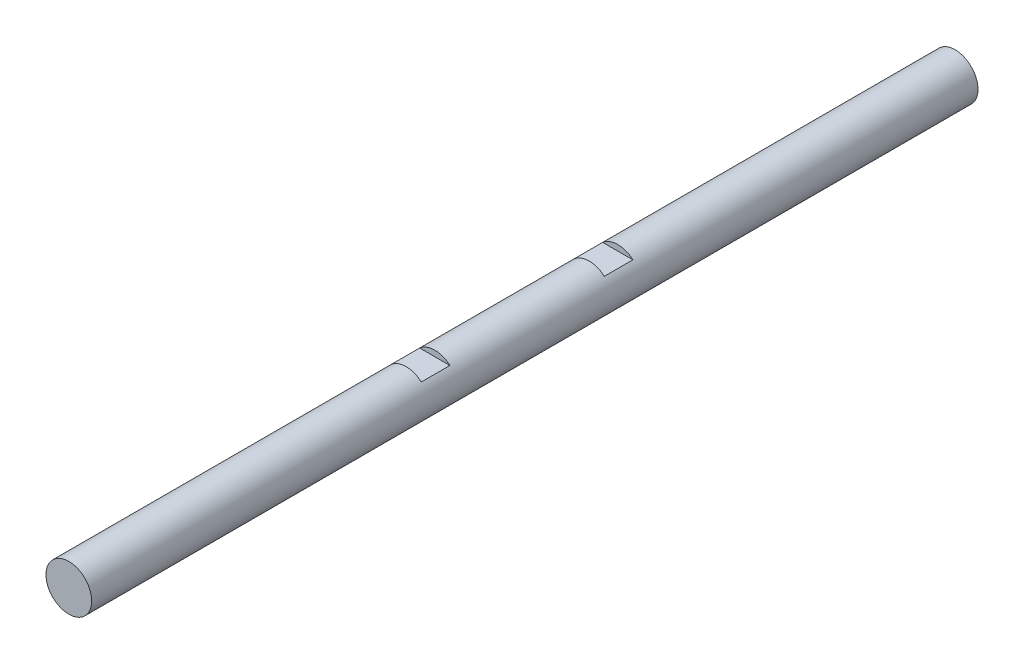
ISO-10303-21;
HEADER;
FILE_DESCRIPTION(('STEP AP214'),'2;1');
FILE_NAME('part.step','',(''),(''),'','','');
FILE_SCHEMA(('AUTOMOTIVE_DESIGN { 1 0 10303 214 1 1 1 1 }'));
ENDSEC;
DATA;
#1=APPLICATION_CONTEXT('core data for automotive mechanical design processes');
#2=APPLICATION_PROTOCOL_DEFINITION('international standard','automotive_design',2000,#1);
#3=PRODUCT_CONTEXT('',#1,'mechanical');
#4=PRODUCT('Part','Part','',(#3));
#5=PRODUCT_RELATED_PRODUCT_CATEGORY('part','',(#4));
#6=PRODUCT_DEFINITION_FORMATION('','',#4);
#7=PRODUCT_DEFINITION_CONTEXT('part definition',#1,'design');
#8=PRODUCT_DEFINITION('design','',#6,#7);
#9=PRODUCT_DEFINITION_SHAPE('','',#8);
#10=(LENGTH_UNIT() NAMED_UNIT(*) SI_UNIT(.MILLI.,.METRE.));
#11=(NAMED_UNIT(*) PLANE_ANGLE_UNIT() SI_UNIT($,.RADIAN.));
#12=(NAMED_UNIT(*) SI_UNIT($,.STERADIAN.) SOLID_ANGLE_UNIT());
#13=UNCERTAINTY_MEASURE_WITH_UNIT(LENGTH_MEASURE(1.E-05),#10,'distance_accuracy_value','');
#14=(GEOMETRIC_REPRESENTATION_CONTEXT(3) GLOBAL_UNCERTAINTY_ASSIGNED_CONTEXT((#13)) GLOBAL_UNIT_ASSIGNED_CONTEXT((#10,
#11,#12)) REPRESENTATION_CONTEXT('',''));
#15=CARTESIAN_POINT('',(0.,0.,0.));
#16=DIRECTION('',(0.,0.,1.));
#17=DIRECTION('',(1.,0.,0.));
#18=AXIS2_PLACEMENT_3D('',#15,#16,#17);
#19=CARTESIAN_POINT('',(0.,0.,-77.5));
#20=DIRECTION('',(0.,0.,1.));
#21=DIRECTION('',(1.,0.,0.));
#22=AXIS2_PLACEMENT_3D('',#19,#20,#21);
#23=CYLINDRICAL_SURFACE('',#22,4.);
#24=CARTESIAN_POINT('',(0.,0.,-13.5));
#25=DIRECTION('',(0.,0.,1.));
#26=DIRECTION('',(1.,0.,0.));
#27=AXIS2_PLACEMENT_3D('',#24,#25,#26);
#28=CIRCLE('',#27,4.);
#29=CARTESIAN_POINT('',(-2.64575131106459,3.,-13.5));
#30=VERTEX_POINT('',#29);
#31=CARTESIAN_POINT('',(2.64575131106459,3.,-13.5));
#32=VERTEX_POINT('',#31);
#33=EDGE_CURVE('E99',#30,#32,#28,.F.);
#34=ORIENTED_EDGE('',*,*,#33,.F.);
#35=DIRECTION('',(0.,0.,1.));
#36=VECTOR('',#35,1.);
#37=CARTESIAN_POINT('',(-2.64575131106459,3.,-77.5));
#38=LINE('',#37,#36);
#39=CARTESIAN_POINT('',(-2.64575131106459,3.,-18.5));
#40=VERTEX_POINT('',#39);
#41=EDGE_CURVE('E11',#40,#30,#38,.T.);
#42=ORIENTED_EDGE('',*,*,#41,.F.);
#43=CARTESIAN_POINT('',(0.,0.,-18.5));
#44=DIRECTION('',(0.,0.,-1.));
#45=DIRECTION('',(0.,1.,0.));
#46=AXIS2_PLACEMENT_3D('',#43,#44,#45);
#47=CIRCLE('',#46,4.);
#48=CARTESIAN_POINT('',(2.64575131106459,3.,-18.5));
#49=VERTEX_POINT('',#48);
#50=EDGE_CURVE('E47',#49,#40,#47,.F.);
#51=ORIENTED_EDGE('',*,*,#50,.F.);
#52=DIRECTION('',(0.,0.,1.));
#53=VECTOR('',#52,1.);
#54=CARTESIAN_POINT('',(2.64575131106459,3.,-77.5));
#55=LINE('',#54,#53);
#56=EDGE_CURVE('E54',#32,#49,#55,.F.);
#57=ORIENTED_EDGE('',*,*,#56,.F.);
#58=EDGE_LOOP('',(#34,#42,#51,#57));
#59=FACE_BOUND('',#58,.T.);
#60=CARTESIAN_POINT('',(0.,0.,18.5));
#61=DIRECTION('',(0.,0.,1.));
#62=DIRECTION('',(1.,0.,0.));
#63=AXIS2_PLACEMENT_3D('',#60,#61,#62);
#64=CIRCLE('',#63,4.);
#65=CARTESIAN_POINT('',(-2.6457513110646,3.,18.5));
#66=VERTEX_POINT('',#65);
#67=CARTESIAN_POINT('',(2.6457513110646,3.,18.5));
#68=VERTEX_POINT('',#67);
#69=EDGE_CURVE('E80',#66,#68,#64,.F.);
#70=ORIENTED_EDGE('',*,*,#69,.F.);
#71=DIRECTION('',(0.,0.,1.));
#72=VECTOR('',#71,1.);
#73=CARTESIAN_POINT('',(-2.64575131106457,3.00000000000002,-77.5));
#74=LINE('',#73,#72);
#75=CARTESIAN_POINT('',(-2.64575131106457,3.,13.5));
#76=VERTEX_POINT('',#75);
#77=EDGE_CURVE('E83',#76,#66,#74,.T.);
#78=ORIENTED_EDGE('',*,*,#77,.F.);
#79=CARTESIAN_POINT('',(0.,0.,13.5));
#80=DIRECTION('',(0.,0.,-1.));
#81=DIRECTION('',(-1.,0.,0.));
#82=AXIS2_PLACEMENT_3D('',#79,#80,#81);
#83=CIRCLE('',#82,4.);
#84=CARTESIAN_POINT('',(2.64575131106457,3.,13.5));
#85=VERTEX_POINT('',#84);
#86=EDGE_CURVE('E100',#85,#76,#83,.F.);
#87=ORIENTED_EDGE('',*,*,#86,.F.);
#88=DIRECTION('',(0.,0.,1.));
#89=VECTOR('',#88,1.);
#90=CARTESIAN_POINT('',(2.64575131106457,3.00000000000002,-77.5));
#91=LINE('',#90,#89);
#92=EDGE_CURVE('E85',#68,#85,#91,.F.);
#93=ORIENTED_EDGE('',*,*,#92,.F.);
#94=EDGE_LOOP('',(#70,#78,#87,#93));
#95=FACE_BOUND('',#94,.T.);
#96=CARTESIAN_POINT('',(0.,0.,-77.5));
#97=DIRECTION('',(0.,0.,1.));
#98=DIRECTION('',(1.,0.,0.));
#99=AXIS2_PLACEMENT_3D('',#96,#97,#98);
#100=CIRCLE('',#99,4.);
#101=CARTESIAN_POINT('',(4.,0.,-77.5));
#102=VERTEX_POINT('',#101);
#103=EDGE_CURVE('E90',#102,#102,#100,.T.);
#104=ORIENTED_EDGE('',*,*,#103,.T.);
#105=EDGE_LOOP('',(#104));
#106=FACE_BOUND('',#105,.T.);
#107=CARTESIAN_POINT('',(0.,0.,77.5));
#108=DIRECTION('',(0.,0.,1.));
#109=DIRECTION('',(1.,0.,0.));
#110=AXIS2_PLACEMENT_3D('',#107,#108,#109);
#111=CIRCLE('',#110,4.);
#112=CARTESIAN_POINT('',(4.,0.,77.5));
#113=VERTEX_POINT('',#112);
#114=EDGE_CURVE('E110',#113,#113,#111,.T.);
#115=ORIENTED_EDGE('',*,*,#114,.F.);
#116=EDGE_LOOP('',(#115));
#117=FACE_BOUND('',#116,.T.);
#118=ADVANCED_FACE('F39',(#59,#95,#106,#117),#23,.T.);
#119=CARTESIAN_POINT('',(0.,0.,-77.5));
#120=DIRECTION('',(0.,0.,1.));
#121=DIRECTION('',(1.,0.,0.));
#122=AXIS2_PLACEMENT_3D('',#119,#120,#121);
#123=PLANE('',#122);
#124=ORIENTED_EDGE('',*,*,#103,.F.);
#125=EDGE_LOOP('',(#124));
#126=FACE_BOUND('',#125,.T.);
#127=ADVANCED_FACE('F144',(#126),#123,.F.);
#128=CARTESIAN_POINT('',(0.,0.,77.5));
#129=DIRECTION('',(0.,0.,1.));
#130=DIRECTION('',(1.,0.,0.));
#131=AXIS2_PLACEMENT_3D('',#128,#129,#130);
#132=PLANE('',#131);
#133=ORIENTED_EDGE('',*,*,#114,.T.);
#134=EDGE_LOOP('',(#133));
#135=FACE_BOUND('',#134,.T.);
#136=ADVANCED_FACE('F148',(#135),#132,.T.);
#137=CARTESIAN_POINT('',(-4.,4.,13.5));
#138=DIRECTION('',(0.,0.,-1.));
#139=DIRECTION('',(-1.,0.,0.));
#140=AXIS2_PLACEMENT_3D('',#137,#138,#139);
#141=PLANE('',#140);
#142=DIRECTION('',(1.,0.,0.));
#143=VECTOR('',#142,1.);
#144=CARTESIAN_POINT('',(-4.,3.,13.5));
#145=LINE('',#144,#143);
#146=EDGE_CURVE('E97',#76,#85,#145,.T.);
#147=ORIENTED_EDGE('',*,*,#146,.T.);
#148=ORIENTED_EDGE('',*,*,#86,.T.);
#149=EDGE_LOOP('',(#147,#148));
#150=FACE_BOUND('',#149,.T.);
#151=ADVANCED_FACE('F153',(#150),#141,.F.);
#152=CARTESIAN_POINT('',(-4.,3.,13.5));
#153=DIRECTION('',(0.,-1.,0.));
#154=DIRECTION('',(0.,0.,-1.));
#155=AXIS2_PLACEMENT_3D('',#152,#153,#154);
#156=PLANE('',#155);
#157=ORIENTED_EDGE('',*,*,#92,.T.);
#158=ORIENTED_EDGE('',*,*,#146,.F.);
#159=ORIENTED_EDGE('',*,*,#77,.T.);
#160=DIRECTION('',(1.,0.,0.));
#161=VECTOR('',#160,1.);
#162=CARTESIAN_POINT('',(-4.,3.,18.5));
#163=LINE('',#162,#161);
#164=EDGE_CURVE('E95',#66,#68,#163,.T.);
#165=ORIENTED_EDGE('',*,*,#164,.T.);
#166=EDGE_LOOP('',(#157,#158,#159,#165));
#167=FACE_BOUND('',#166,.T.);
#168=ADVANCED_FACE('F94',(#167),#156,.F.);
#169=CARTESIAN_POINT('',(-4.,4.,18.5));
#170=DIRECTION('',(0.,0.,1.));
#171=DIRECTION('',(1.,0.,0.));
#172=AXIS2_PLACEMENT_3D('',#169,#170,#171);
#173=PLANE('',#172);
#174=ORIENTED_EDGE('',*,*,#164,.F.);
#175=ORIENTED_EDGE('',*,*,#69,.T.);
#176=EDGE_LOOP('',(#174,#175));
#177=FACE_BOUND('',#176,.T.);
#178=ADVANCED_FACE('F102',(#177),#173,.F.);
#179=CARTESIAN_POINT('',(-4.,4.,-18.5));
#180=DIRECTION('',(0.,0.,-1.));
#181=DIRECTION('',(0.,1.,0.));
#182=AXIS2_PLACEMENT_3D('',#179,#180,#181);
#183=PLANE('',#182);
#184=ORIENTED_EDGE('',*,*,#50,.T.);
#185=DIRECTION('',(1.,0.,0.));
#186=VECTOR('',#185,1.);
#187=CARTESIAN_POINT('',(-4.,3.,-18.5));
#188=LINE('',#187,#186);
#189=EDGE_CURVE('E114',#40,#49,#188,.T.);
#190=ORIENTED_EDGE('',*,*,#189,.T.);
#191=EDGE_LOOP('',(#184,#190));
#192=FACE_BOUND('',#191,.T.);
#193=ADVANCED_FACE('F140',(#192),#183,.F.);
#194=CARTESIAN_POINT('',(-4.,3.,-18.5));
#195=DIRECTION('',(0.,-1.,0.));
#196=DIRECTION('',(0.,0.,-1.));
#197=AXIS2_PLACEMENT_3D('',#194,#195,#196);
#198=PLANE('',#197);
#199=ORIENTED_EDGE('',*,*,#56,.T.);
#200=ORIENTED_EDGE('',*,*,#189,.F.);
#201=ORIENTED_EDGE('',*,*,#41,.T.);
#202=DIRECTION('',(1.,0.,0.));
#203=VECTOR('',#202,1.);
#204=CARTESIAN_POINT('',(-4.,3.,-13.5));
#205=LINE('',#204,#203);
#206=EDGE_CURVE('E106',#30,#32,#205,.T.);
#207=ORIENTED_EDGE('',*,*,#206,.T.);
#208=EDGE_LOOP('',(#199,#200,#201,#207));
#209=FACE_BOUND('',#208,.T.);
#210=ADVANCED_FACE('F130',(#209),#198,.F.);
#211=CARTESIAN_POINT('',(-4.,4.,-13.5));
#212=DIRECTION('',(0.,0.,1.));
#213=DIRECTION('',(1.,0.,0.));
#214=AXIS2_PLACEMENT_3D('',#211,#212,#213);
#215=PLANE('',#214);
#216=ORIENTED_EDGE('',*,*,#206,.F.);
#217=ORIENTED_EDGE('',*,*,#33,.T.);
#218=EDGE_LOOP('',(#216,#217));
#219=FACE_BOUND('',#218,.T.);
#220=ADVANCED_FACE('F134',(#219),#215,.F.);
#221=CLOSED_SHELL('',(#118,#127,#136,#151,#168,#178,#193,#210,#220));
#222=MANIFOLD_SOLID_BREP('B2',#221);
#223=ADVANCED_BREP_SHAPE_REPRESENTATION('',(#18,#222),#14);
#224=SHAPE_DEFINITION_REPRESENTATION(#9,#223);
ENDSEC;
END-ISO-10303-21;
